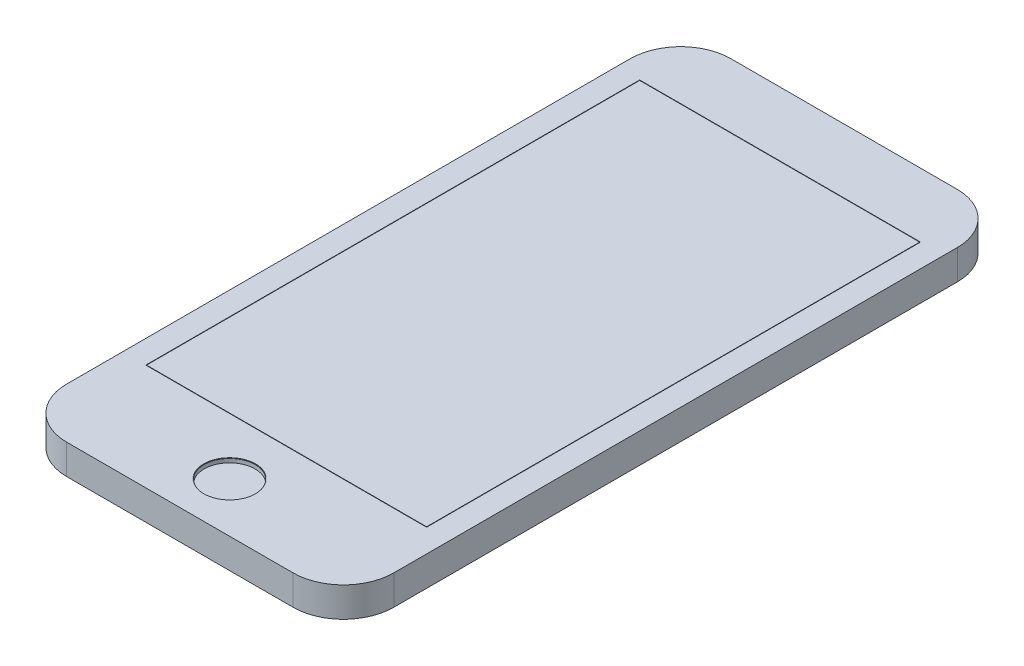
ISO-10303-21;
HEADER;
FILE_DESCRIPTION(('STEP AP214'),'2;1');
FILE_NAME('part.step','',(''),(''),'','','');
FILE_SCHEMA(('AUTOMOTIVE_DESIGN { 1 0 10303 214 1 1 1 1 }'));
ENDSEC;
DATA;
#1=APPLICATION_CONTEXT('core data for automotive mechanical design processes');
#2=APPLICATION_PROTOCOL_DEFINITION('international standard','automotive_design',2000,#1);
#3=PRODUCT_CONTEXT('',#1,'mechanical');
#4=PRODUCT('Part','Part','',(#3));
#5=PRODUCT_RELATED_PRODUCT_CATEGORY('part','',(#4));
#6=PRODUCT_DEFINITION_FORMATION('','',#4);
#7=PRODUCT_DEFINITION_CONTEXT('part definition',#1,'design');
#8=PRODUCT_DEFINITION('design','',#6,#7);
#9=PRODUCT_DEFINITION_SHAPE('','',#8);
#10=(LENGTH_UNIT() NAMED_UNIT(*) SI_UNIT(.MILLI.,.METRE.));
#11=(NAMED_UNIT(*) PLANE_ANGLE_UNIT() SI_UNIT($,.RADIAN.));
#12=(NAMED_UNIT(*) SI_UNIT($,.STERADIAN.) SOLID_ANGLE_UNIT());
#13=UNCERTAINTY_MEASURE_WITH_UNIT(LENGTH_MEASURE(1.E-05),#10,'distance_accuracy_value','');
#14=(GEOMETRIC_REPRESENTATION_CONTEXT(3) GLOBAL_UNCERTAINTY_ASSIGNED_CONTEXT((#13)) GLOBAL_UNIT_ASSIGNED_CONTEXT((#10,
#11,#12)) REPRESENTATION_CONTEXT('',''));
#15=CARTESIAN_POINT('',(0.,0.,0.));
#16=DIRECTION('',(0.,0.,1.));
#17=DIRECTION('',(1.,0.,0.));
#18=AXIS2_PLACEMENT_3D('',#15,#16,#17);
#19=CARTESIAN_POINT('',(26.95,7.1,67.1));
#20=DIRECTION('',(0.,-1.,0.));
#21=DIRECTION('',(0.,0.,-1.));
#22=AXIS2_PLACEMENT_3D('',#19,#20,#21);
#23=CYLINDRICAL_SURFACE('',#22,12.);
#24=CARTESIAN_POINT('',(26.95,0.,67.1));
#25=DIRECTION('',(0.,1.,0.));
#26=DIRECTION('',(0.,0.,1.));
#27=AXIS2_PLACEMENT_3D('',#24,#25,#26);
#28=CIRCLE('',#27,12.);
#29=CARTESIAN_POINT('',(26.9499999999999,0.,79.1));
#30=VERTEX_POINT('',#29);
#31=CARTESIAN_POINT('',(38.95,0.,67.0999999999999));
#32=VERTEX_POINT('',#31);
#33=EDGE_CURVE('E257',#30,#32,#28,.T.);
#34=ORIENTED_EDGE('',*,*,#33,.T.);
#35=DIRECTION('',(0.,-1.,0.));
#36=VECTOR('',#35,1.);
#37=CARTESIAN_POINT('',(38.95,7.1,67.0999999999999));
#38=LINE('',#37,#36);
#39=CARTESIAN_POINT('',(38.95,7.1,67.0999999999999));
#40=VERTEX_POINT('',#39);
#41=EDGE_CURVE('E12',#40,#32,#38,.T.);
#42=ORIENTED_EDGE('',*,*,#41,.F.);
#43=CARTESIAN_POINT('',(26.95,7.1,67.1));
#44=DIRECTION('',(0.,1.,0.));
#45=DIRECTION('',(0.,0.,1.));
#46=AXIS2_PLACEMENT_3D('',#43,#44,#45);
#47=CIRCLE('',#46,12.);
#48=CARTESIAN_POINT('',(26.9499999999999,7.1,79.1));
#49=VERTEX_POINT('',#48);
#50=EDGE_CURVE('E259',#49,#40,#47,.T.);
#51=ORIENTED_EDGE('',*,*,#50,.F.);
#52=DIRECTION('',(0.,-1.,0.));
#53=VECTOR('',#52,1.);
#54=CARTESIAN_POINT('',(26.9499999999999,7.1,79.1));
#55=LINE('',#54,#53);
#56=EDGE_CURVE('E277',#49,#30,#55,.T.);
#57=ORIENTED_EDGE('',*,*,#56,.T.);
#58=EDGE_LOOP('',(#34,#42,#51,#57));
#59=FACE_BOUND('',#58,.T.);
#60=ADVANCED_FACE('F67',(#59),#23,.T.);
#61=CARTESIAN_POINT('',(38.95,7.1,-67.0999999999999));
#62=DIRECTION('',(-1.,0.,0.));
#63=DIRECTION('',(0.,0.,1.));
#64=AXIS2_PLACEMENT_3D('',#61,#62,#63);
#65=PLANE('',#64);
#66=DIRECTION('',(0.,0.,-1.));
#67=VECTOR('',#66,1.);
#68=CARTESIAN_POINT('',(38.95,0.,-67.0999999999999));
#69=LINE('',#68,#67);
#70=CARTESIAN_POINT('',(38.95,0.,-67.0999999999999));
#71=VERTEX_POINT('',#70);
#72=EDGE_CURVE('E280',#32,#71,#69,.T.);
#73=ORIENTED_EDGE('',*,*,#72,.T.);
#74=DIRECTION('',(0.,-1.,0.));
#75=VECTOR('',#74,1.);
#76=CARTESIAN_POINT('',(38.95,7.1,-67.0999999999999));
#77=LINE('',#76,#75);
#78=CARTESIAN_POINT('',(38.95,7.1,-67.0999999999999));
#79=VERTEX_POINT('',#78);
#80=EDGE_CURVE('E74',#79,#71,#77,.T.);
#81=ORIENTED_EDGE('',*,*,#80,.F.);
#82=DIRECTION('',(0.,0.,-1.));
#83=VECTOR('',#82,1.);
#84=CARTESIAN_POINT('',(38.95,7.1,-67.0999999999999));
#85=LINE('',#84,#83);
#86=EDGE_CURVE('E262',#40,#79,#85,.T.);
#87=ORIENTED_EDGE('',*,*,#86,.F.);
#88=ORIENTED_EDGE('',*,*,#41,.T.);
#89=EDGE_LOOP('',(#73,#81,#87,#88));
#90=FACE_BOUND('',#89,.T.);
#91=ADVANCED_FACE('F337',(#90),#65,.F.);
#92=CARTESIAN_POINT('',(26.95,7.1,-67.1));
#93=DIRECTION('',(0.,-1.,0.));
#94=DIRECTION('',(0.,0.,-1.));
#95=AXIS2_PLACEMENT_3D('',#92,#93,#94);
#96=CYLINDRICAL_SURFACE('',#95,12.);
#97=CARTESIAN_POINT('',(26.95,0.,-67.1));
#98=DIRECTION('',(0.,1.,0.));
#99=DIRECTION('',(0.,0.,1.));
#100=AXIS2_PLACEMENT_3D('',#97,#98,#99);
#101=CIRCLE('',#100,12.);
#102=CARTESIAN_POINT('',(26.9499999999999,0.,-79.1));
#103=VERTEX_POINT('',#102);
#104=EDGE_CURVE('E282',#71,#103,#101,.T.);
#105=ORIENTED_EDGE('',*,*,#104,.T.);
#106=DIRECTION('',(0.,-1.,0.));
#107=VECTOR('',#106,1.);
#108=CARTESIAN_POINT('',(26.9499999999999,7.1,-79.1));
#109=LINE('',#108,#107);
#110=CARTESIAN_POINT('',(26.9499999999999,7.1,-79.1));
#111=VERTEX_POINT('',#110);
#112=EDGE_CURVE('E307',#111,#103,#109,.T.);
#113=ORIENTED_EDGE('',*,*,#112,.F.);
#114=CARTESIAN_POINT('',(26.95,7.1,-67.1));
#115=DIRECTION('',(0.,1.,0.));
#116=DIRECTION('',(0.,0.,1.));
#117=AXIS2_PLACEMENT_3D('',#114,#115,#116);
#118=CIRCLE('',#117,12.);
#119=EDGE_CURVE('E265',#79,#111,#118,.T.);
#120=ORIENTED_EDGE('',*,*,#119,.F.);
#121=ORIENTED_EDGE('',*,*,#80,.T.);
#122=EDGE_LOOP('',(#105,#113,#120,#121));
#123=FACE_BOUND('',#122,.T.);
#124=ADVANCED_FACE('F314',(#123),#96,.T.);
#125=CARTESIAN_POINT('',(26.9499999999999,7.1,-79.1));
#126=DIRECTION('',(0.,0.,1.));
#127=DIRECTION('',(1.,0.,0.));
#128=AXIS2_PLACEMENT_3D('',#125,#126,#127);
#129=PLANE('',#128);
#130=DIRECTION('',(-1.,0.,0.));
#131=VECTOR('',#130,1.);
#132=CARTESIAN_POINT('',(26.9499999999999,0.,-79.1));
#133=LINE('',#132,#131);
#134=CARTESIAN_POINT('',(-26.95,0.,-79.1));
#135=VERTEX_POINT('',#134);
#136=EDGE_CURVE('E284',#103,#135,#133,.T.);
#137=ORIENTED_EDGE('',*,*,#136,.T.);
#138=DIRECTION('',(0.,-1.,0.));
#139=VECTOR('',#138,1.);
#140=CARTESIAN_POINT('',(-26.95,7.1,-79.1));
#141=LINE('',#140,#139);
#142=CARTESIAN_POINT('',(-26.95,7.1,-79.1));
#143=VERTEX_POINT('',#142);
#144=EDGE_CURVE('E304',#143,#135,#141,.T.);
#145=ORIENTED_EDGE('',*,*,#144,.F.);
#146=DIRECTION('',(-1.,0.,0.));
#147=VECTOR('',#146,1.);
#148=CARTESIAN_POINT('',(26.9499999999999,7.1,-79.1));
#149=LINE('',#148,#147);
#150=EDGE_CURVE('E267',#111,#143,#149,.T.);
#151=ORIENTED_EDGE('',*,*,#150,.F.);
#152=ORIENTED_EDGE('',*,*,#112,.T.);
#153=EDGE_LOOP('',(#137,#145,#151,#152));
#154=FACE_BOUND('',#153,.T.);
#155=ADVANCED_FACE('F325',(#154),#129,.F.);
#156=CARTESIAN_POINT('',(-26.95,7.1,-67.1));
#157=DIRECTION('',(0.,-1.,0.));
#158=DIRECTION('',(0.,0.,-1.));
#159=AXIS2_PLACEMENT_3D('',#156,#157,#158);
#160=CYLINDRICAL_SURFACE('',#159,12.);
#161=CARTESIAN_POINT('',(-26.95,0.,-67.1));
#162=DIRECTION('',(0.,1.,0.));
#163=DIRECTION('',(0.,0.,-1.));
#164=AXIS2_PLACEMENT_3D('',#161,#162,#163);
#165=CIRCLE('',#164,12.);
#166=CARTESIAN_POINT('',(-38.95,0.,-67.0999999999999));
#167=VERTEX_POINT('',#166);
#168=EDGE_CURVE('E286',#135,#167,#165,.T.);
#169=ORIENTED_EDGE('',*,*,#168,.T.);
#170=DIRECTION('',(0.,-1.,0.));
#171=VECTOR('',#170,1.);
#172=CARTESIAN_POINT('',(-38.95,7.1,-67.0999999999999));
#173=LINE('',#172,#171);
#174=CARTESIAN_POINT('',(-38.95,7.1,-67.0999999999999));
#175=VERTEX_POINT('',#174);
#176=EDGE_CURVE('E301',#175,#167,#173,.T.);
#177=ORIENTED_EDGE('',*,*,#176,.F.);
#178=CARTESIAN_POINT('',(-26.95,7.1,-67.1));
#179=DIRECTION('',(0.,1.,0.));
#180=DIRECTION('',(0.,0.,-1.));
#181=AXIS2_PLACEMENT_3D('',#178,#179,#180);
#182=CIRCLE('',#181,12.);
#183=EDGE_CURVE('E269',#143,#175,#182,.T.);
#184=ORIENTED_EDGE('',*,*,#183,.F.);
#185=ORIENTED_EDGE('',*,*,#144,.T.);
#186=EDGE_LOOP('',(#169,#177,#184,#185));
#187=FACE_BOUND('',#186,.T.);
#188=ADVANCED_FACE('F329',(#187),#160,.T.);
#189=CARTESIAN_POINT('',(-38.95,7.1,-67.0999999999999));
#190=DIRECTION('',(1.,0.,0.));
#191=DIRECTION('',(0.,0.,-1.));
#192=AXIS2_PLACEMENT_3D('',#189,#190,#191);
#193=PLANE('',#192);
#194=DIRECTION('',(0.,0.,1.));
#195=VECTOR('',#194,1.);
#196=CARTESIAN_POINT('',(-38.95,0.,-67.0999999999999));
#197=LINE('',#196,#195);
#198=CARTESIAN_POINT('',(-38.95,0.,67.0999999999999));
#199=VERTEX_POINT('',#198);
#200=EDGE_CURVE('E288',#167,#199,#197,.T.);
#201=ORIENTED_EDGE('',*,*,#200,.T.);
#202=DIRECTION('',(0.,-1.,0.));
#203=VECTOR('',#202,1.);
#204=CARTESIAN_POINT('',(-38.95,7.1,67.0999999999999));
#205=LINE('',#204,#203);
#206=CARTESIAN_POINT('',(-38.95,7.1,67.0999999999999));
#207=VERTEX_POINT('',#206);
#208=EDGE_CURVE('E298',#207,#199,#205,.T.);
#209=ORIENTED_EDGE('',*,*,#208,.F.);
#210=DIRECTION('',(0.,0.,1.));
#211=VECTOR('',#210,1.);
#212=CARTESIAN_POINT('',(-38.95,7.1,-67.0999999999999));
#213=LINE('',#212,#211);
#214=EDGE_CURVE('E271',#175,#207,#213,.T.);
#215=ORIENTED_EDGE('',*,*,#214,.F.);
#216=ORIENTED_EDGE('',*,*,#176,.T.);
#217=EDGE_LOOP('',(#201,#209,#215,#216));
#218=FACE_BOUND('',#217,.T.);
#219=ADVANCED_FACE('F350',(#218),#193,.F.);
#220=CARTESIAN_POINT('',(-26.95,7.1,67.1));
#221=DIRECTION('',(0.,-1.,0.));
#222=DIRECTION('',(0.,0.,-1.));
#223=AXIS2_PLACEMENT_3D('',#220,#221,#222);
#224=CYLINDRICAL_SURFACE('',#223,12.);
#225=CARTESIAN_POINT('',(-26.95,0.,67.1));
#226=DIRECTION('',(0.,1.,0.));
#227=DIRECTION('',(0.,0.,-1.));
#228=AXIS2_PLACEMENT_3D('',#225,#226,#227);
#229=CIRCLE('',#228,12.);
#230=CARTESIAN_POINT('',(-26.9499999999999,0.,79.1));
#231=VERTEX_POINT('',#230);
#232=EDGE_CURVE('E290',#199,#231,#229,.T.);
#233=ORIENTED_EDGE('',*,*,#232,.T.);
#234=DIRECTION('',(0.,-1.,0.));
#235=VECTOR('',#234,1.);
#236=CARTESIAN_POINT('',(-26.9499999999999,7.1,79.1));
#237=LINE('',#236,#235);
#238=CARTESIAN_POINT('',(-26.9499999999999,7.1,79.1));
#239=VERTEX_POINT('',#238);
#240=EDGE_CURVE('E295',#239,#231,#237,.T.);
#241=ORIENTED_EDGE('',*,*,#240,.F.);
#242=CARTESIAN_POINT('',(-26.95,7.1,67.1));
#243=DIRECTION('',(0.,1.,0.));
#244=DIRECTION('',(0.,0.,-1.));
#245=AXIS2_PLACEMENT_3D('',#242,#243,#244);
#246=CIRCLE('',#245,12.);
#247=EDGE_CURVE('E273',#207,#239,#246,.T.);
#248=ORIENTED_EDGE('',*,*,#247,.F.);
#249=ORIENTED_EDGE('',*,*,#208,.T.);
#250=EDGE_LOOP('',(#233,#241,#248,#249));
#251=FACE_BOUND('',#250,.T.);
#252=ADVANCED_FACE('F348',(#251),#224,.T.);
#253=CARTESIAN_POINT('',(26.9499999999999,7.1,79.1));
#254=DIRECTION('',(0.,0.,-1.));
#255=DIRECTION('',(-1.,0.,0.));
#256=AXIS2_PLACEMENT_3D('',#253,#254,#255);
#257=PLANE('',#256);
#258=DIRECTION('',(1.,0.,0.));
#259=VECTOR('',#258,1.);
#260=CARTESIAN_POINT('',(26.9499999999999,0.,79.1));
#261=LINE('',#260,#259);
#262=EDGE_CURVE('E263',#231,#30,#261,.T.);
#263=ORIENTED_EDGE('',*,*,#262,.T.);
#264=ORIENTED_EDGE('',*,*,#56,.F.);
#265=DIRECTION('',(1.,0.,0.));
#266=VECTOR('',#265,1.);
#267=CARTESIAN_POINT('',(26.9499999999999,7.1,79.1));
#268=LINE('',#267,#266);
#269=EDGE_CURVE('E275',#239,#49,#268,.T.);
#270=ORIENTED_EDGE('',*,*,#269,.F.);
#271=ORIENTED_EDGE('',*,*,#240,.T.);
#272=EDGE_LOOP('',(#263,#264,#270,#271));
#273=FACE_BOUND('',#272,.T.);
#274=ADVANCED_FACE('F343',(#273),#257,.F.);
#275=CARTESIAN_POINT('',(26.95,7.1,67.1));
#276=DIRECTION('',(0.,1.,0.));
#277=DIRECTION('',(0.,0.,1.));
#278=AXIS2_PLACEMENT_3D('',#275,#276,#277);
#279=PLANE('',#278);
#280=CARTESIAN_POINT('',(0.,7.1,67.2515398460467));
#281=DIRECTION('',(0.,1.,0.));
#282=DIRECTION('',(1.,0.,0.));
#283=AXIS2_PLACEMENT_3D('',#280,#281,#282);
#284=CIRCLE('',#283,6.17081666967391);
#285=CARTESIAN_POINT('',(6.17081666967389,7.1,67.2515398460467));
#286=VERTEX_POINT('',#285);
#287=EDGE_CURVE('E210',#286,#286,#284,.T.);
#288=ORIENTED_EDGE('',*,*,#287,.F.);
#289=EDGE_LOOP('',(#288));
#290=FACE_BOUND('',#289,.T.);
#291=DIRECTION('',(0.,0.,-1.));
#292=VECTOR('',#291,1.);
#293=CARTESIAN_POINT('',(33.4428160243408,7.1,-63.7497866125761));
#294=LINE('',#293,#292);
#295=CARTESIAN_POINT('',(33.4428160243408,7.1,53.784030831643));
#296=VERTEX_POINT('',#295);
#297=CARTESIAN_POINT('',(33.4428160243408,7.1,-63.8497866125761));
#298=VERTEX_POINT('',#297);
#299=EDGE_CURVE('E81',#296,#298,#294,.T.);
#300=ORIENTED_EDGE('',*,*,#299,.F.);
#301=DIRECTION('',(1.,0.,0.));
#302=VECTOR('',#301,1.);
#303=CARTESIAN_POINT('',(-33.3428160243409,7.1,53.784030831643));
#304=LINE('',#303,#302);
#305=CARTESIAN_POINT('',(-33.4428160243409,7.1,53.784030831643));
#306=VERTEX_POINT('',#305);
#307=EDGE_CURVE('E227',#306,#296,#304,.T.);
#308=ORIENTED_EDGE('',*,*,#307,.F.);
#309=DIRECTION('',(0.,0.,1.));
#310=VECTOR('',#309,1.);
#311=CARTESIAN_POINT('',(-33.4428160243409,7.1,-63.7497866125761));
#312=LINE('',#311,#310);
#313=CARTESIAN_POINT('',(-33.4428160243409,7.1,-63.8497866125761));
#314=VERTEX_POINT('',#313);
#315=EDGE_CURVE('E241',#314,#306,#312,.T.);
#316=ORIENTED_EDGE('',*,*,#315,.F.);
#317=DIRECTION('',(-1.,0.,0.));
#318=VECTOR('',#317,1.);
#319=CARTESIAN_POINT('',(-33.3428160243409,7.1,-63.8497866125761));
#320=LINE('',#319,#318);
#321=EDGE_CURVE('E238',#298,#314,#320,.T.);
#322=ORIENTED_EDGE('',*,*,#321,.F.);
#323=EDGE_LOOP('',(#300,#308,#316,#322));
#324=FACE_BOUND('',#323,.T.);
#325=ORIENTED_EDGE('',*,*,#50,.T.);
#326=ORIENTED_EDGE('',*,*,#86,.T.);
#327=ORIENTED_EDGE('',*,*,#119,.T.);
#328=ORIENTED_EDGE('',*,*,#150,.T.);
#329=ORIENTED_EDGE('',*,*,#183,.T.);
#330=ORIENTED_EDGE('',*,*,#214,.T.);
#331=ORIENTED_EDGE('',*,*,#247,.T.);
#332=ORIENTED_EDGE('',*,*,#269,.T.);
#333=EDGE_LOOP('',(#325,#326,#327,#328,#329,#330,#331,#332));
#334=FACE_BOUND('',#333,.T.);
#335=ADVANCED_FACE('F333',(#290,#324,#334),#279,.T.);
#336=CARTESIAN_POINT('',(26.95,0.,67.1));
#337=DIRECTION('',(0.,1.,0.));
#338=DIRECTION('',(0.,0.,1.));
#339=AXIS2_PLACEMENT_3D('',#336,#337,#338);
#340=PLANE('',#339);
#341=ORIENTED_EDGE('',*,*,#33,.F.);
#342=ORIENTED_EDGE('',*,*,#262,.F.);
#343=ORIENTED_EDGE('',*,*,#232,.F.);
#344=ORIENTED_EDGE('',*,*,#200,.F.);
#345=ORIENTED_EDGE('',*,*,#168,.F.);
#346=ORIENTED_EDGE('',*,*,#136,.F.);
#347=ORIENTED_EDGE('',*,*,#104,.F.);
#348=ORIENTED_EDGE('',*,*,#72,.F.);
#349=EDGE_LOOP('',(#341,#342,#343,#344,#345,#346,#347,#348));
#350=FACE_BOUND('',#349,.T.);
#351=ADVANCED_FACE('F320',(#350),#340,.F.);
#352=CARTESIAN_POINT('',(0.,7.,67.2515398460467));
#353=DIRECTION('',(0.,1.,0.));
#354=DIRECTION('',(0.,0.,1.));
#355=AXIS2_PLACEMENT_3D('',#352,#353,#354);
#356=CYLINDRICAL_SURFACE('',#355,6.17081666967391);
#357=CARTESIAN_POINT('',(0.,7.,67.2515398460467));
#358=DIRECTION('',(0.,1.,0.));
#359=DIRECTION('',(1.,0.,0.));
#360=AXIS2_PLACEMENT_3D('',#357,#358,#359);
#361=CIRCLE('',#360,6.17081666967391);
#362=CARTESIAN_POINT('',(6.17081666967389,7.,67.2515398460467));
#363=VERTEX_POINT('',#362);
#364=EDGE_CURVE('E258',#363,#363,#361,.T.);
#365=ORIENTED_EDGE('',*,*,#364,.F.);
#366=EDGE_LOOP('',(#365));
#367=FACE_BOUND('',#366,.T.);
#368=ORIENTED_EDGE('',*,*,#287,.T.);
#369=EDGE_LOOP('',(#368));
#370=FACE_BOUND('',#369,.T.);
#371=ADVANCED_FACE('F406',(#367,#370),#356,.F.);
#372=CARTESIAN_POINT('',(0.,7.,67.2515398460467));
#373=DIRECTION('',(0.,1.,0.));
#374=DIRECTION('',(0.,0.,1.));
#375=AXIS2_PLACEMENT_3D('',#372,#373,#374);
#376=PLANE('',#375);
#377=CARTESIAN_POINT('',(0.,7.,67.2515398460467));
#378=DIRECTION('',(0.,1.,0.));
#379=DIRECTION('',(0.,0.,1.));
#380=AXIS2_PLACEMENT_3D('',#377,#378,#379);
#381=CIRCLE('',#380,6.07081666967391);
#382=CARTESIAN_POINT('',(0.,7.,73.3223565157206));
#383=VERTEX_POINT('',#382);
#384=EDGE_CURVE('E248',#383,#383,#381,.T.);
#385=ORIENTED_EDGE('',*,*,#384,.F.);
#386=EDGE_LOOP('',(#385));
#387=FACE_BOUND('',#386,.T.);
#388=ORIENTED_EDGE('',*,*,#364,.T.);
#389=EDGE_LOOP('',(#388));
#390=FACE_BOUND('',#389,.T.);
#391=ADVANCED_FACE('F437',(#387,#390),#376,.T.);
#392=CARTESIAN_POINT('',(33.4428160243408,7.,-63.7497866125761));
#393=DIRECTION('',(1.,0.,0.));
#394=DIRECTION('',(0.,0.,-1.));
#395=AXIS2_PLACEMENT_3D('',#392,#393,#394);
#396=PLANE('',#395);
#397=ORIENTED_EDGE('',*,*,#299,.T.);
#398=DIRECTION('',(0.,1.,0.));
#399=VECTOR('',#398,1.);
#400=CARTESIAN_POINT('',(33.4428160243408,7.,-63.8497866125761));
#401=LINE('',#400,#399);
#402=CARTESIAN_POINT('',(33.4428160243408,7.,-63.8497866125761));
#403=VERTEX_POINT('',#402);
#404=EDGE_CURVE('E236',#403,#298,#401,.T.);
#405=ORIENTED_EDGE('',*,*,#404,.F.);
#406=DIRECTION('',(0.,0.,-1.));
#407=VECTOR('',#406,1.);
#408=CARTESIAN_POINT('',(33.4428160243408,7.,-63.7497866125761));
#409=LINE('',#408,#407);
#410=CARTESIAN_POINT('',(33.4428160243408,7.,53.784030831643));
#411=VERTEX_POINT('',#410);
#412=EDGE_CURVE('E223',#411,#403,#409,.T.);
#413=ORIENTED_EDGE('',*,*,#412,.F.);
#414=DIRECTION('',(0.,1.,0.));
#415=VECTOR('',#414,1.);
#416=CARTESIAN_POINT('',(33.4428160243408,7.,53.784030831643));
#417=LINE('',#416,#415);
#418=EDGE_CURVE('E246',#411,#296,#417,.T.);
#419=ORIENTED_EDGE('',*,*,#418,.T.);
#420=EDGE_LOOP('',(#397,#405,#413,#419));
#421=FACE_BOUND('',#420,.T.);
#422=ADVANCED_FACE('F448',(#421),#396,.F.);
#423=CARTESIAN_POINT('',(-33.3428160243409,7.,53.784030831643));
#424=DIRECTION('',(0.,0.,1.));
#425=DIRECTION('',(1.,0.,0.));
#426=AXIS2_PLACEMENT_3D('',#423,#424,#425);
#427=PLANE('',#426);
#428=ORIENTED_EDGE('',*,*,#307,.T.);
#429=ORIENTED_EDGE('',*,*,#418,.F.);
#430=DIRECTION('',(1.,0.,0.));
#431=VECTOR('',#430,1.);
#432=CARTESIAN_POINT('',(-33.3428160243409,7.,53.784030831643));
#433=LINE('',#432,#431);
#434=CARTESIAN_POINT('',(-33.4428160243409,7.,53.784030831643));
#435=VERTEX_POINT('',#434);
#436=EDGE_CURVE('E233',#435,#411,#433,.T.);
#437=ORIENTED_EDGE('',*,*,#436,.F.);
#438=DIRECTION('',(0.,1.,0.));
#439=VECTOR('',#438,1.);
#440=CARTESIAN_POINT('',(-33.4428160243409,7.,53.784030831643));
#441=LINE('',#440,#439);
#442=EDGE_CURVE('E249',#435,#306,#441,.T.);
#443=ORIENTED_EDGE('',*,*,#442,.T.);
#444=EDGE_LOOP('',(#428,#429,#437,#443));
#445=FACE_BOUND('',#444,.T.);
#446=ADVANCED_FACE('F458',(#445),#427,.F.);
#447=CARTESIAN_POINT('',(-33.4428160243409,7.,-63.7497866125761));
#448=DIRECTION('',(-1.,0.,0.));
#449=DIRECTION('',(0.,0.,1.));
#450=AXIS2_PLACEMENT_3D('',#447,#448,#449);
#451=PLANE('',#450);
#452=ORIENTED_EDGE('',*,*,#315,.T.);
#453=ORIENTED_EDGE('',*,*,#442,.F.);
#454=DIRECTION('',(0.,0.,1.));
#455=VECTOR('',#454,1.);
#456=CARTESIAN_POINT('',(-33.4428160243409,7.,-63.7497866125761));
#457=LINE('',#456,#455);
#458=CARTESIAN_POINT('',(-33.4428160243409,7.,-63.8497866125761));
#459=VERTEX_POINT('',#458);
#460=EDGE_CURVE('E230',#459,#435,#457,.T.);
#461=ORIENTED_EDGE('',*,*,#460,.F.);
#462=DIRECTION('',(0.,1.,0.));
#463=VECTOR('',#462,1.);
#464=CARTESIAN_POINT('',(-33.4428160243409,7.,-63.8497866125761));
#465=LINE('',#464,#463);
#466=EDGE_CURVE('E251',#459,#314,#465,.T.);
#467=ORIENTED_EDGE('',*,*,#466,.T.);
#468=EDGE_LOOP('',(#452,#453,#461,#467));
#469=FACE_BOUND('',#468,.T.);
#470=ADVANCED_FACE('F467',(#469),#451,.F.);
#471=CARTESIAN_POINT('',(-33.3428160243409,7.,-63.8497866125761));
#472=DIRECTION('',(0.,0.,-1.));
#473=DIRECTION('',(-1.,0.,0.));
#474=AXIS2_PLACEMENT_3D('',#471,#472,#473);
#475=PLANE('',#474);
#476=ORIENTED_EDGE('',*,*,#321,.T.);
#477=ORIENTED_EDGE('',*,*,#466,.F.);
#478=DIRECTION('',(-1.,0.,0.));
#479=VECTOR('',#478,1.);
#480=CARTESIAN_POINT('',(-33.3428160243409,7.,-63.8497866125761));
#481=LINE('',#480,#479);
#482=EDGE_CURVE('E226',#403,#459,#481,.T.);
#483=ORIENTED_EDGE('',*,*,#482,.F.);
#484=ORIENTED_EDGE('',*,*,#404,.T.);
#485=EDGE_LOOP('',(#476,#477,#483,#484));
#486=FACE_BOUND('',#485,.T.);
#487=ADVANCED_FACE('F477',(#486),#475,.F.);
#488=CARTESIAN_POINT('',(0.,7.,0.));
#489=DIRECTION('',(0.,1.,0.));
#490=DIRECTION('',(0.,0.,1.));
#491=AXIS2_PLACEMENT_3D('',#488,#489,#490);
#492=PLANE('',#491);
#493=DIRECTION('',(1.,0.,0.));
#494=VECTOR('',#493,1.);
#495=CARTESIAN_POINT('',(-33.3428160243409,7.,53.684030831643));
#496=LINE('',#495,#494);
#497=CARTESIAN_POINT('',(-33.3428160243409,7.,53.684030831643));
#498=VERTEX_POINT('',#497);
#499=CARTESIAN_POINT('',(33.3428160243408,7.,53.684030831643));
#500=VERTEX_POINT('',#499);
#501=EDGE_CURVE('E191',#498,#500,#496,.T.);
#502=ORIENTED_EDGE('',*,*,#501,.F.);
#503=DIRECTION('',(0.,0.,1.));
#504=VECTOR('',#503,1.);
#505=CARTESIAN_POINT('',(-33.3428160243409,7.,-63.7497866125761));
#506=LINE('',#505,#504);
#507=CARTESIAN_POINT('',(-33.3428160243409,7.,-63.7497866125761));
#508=VERTEX_POINT('',#507);
#509=EDGE_CURVE('E201',#508,#498,#506,.T.);
#510=ORIENTED_EDGE('',*,*,#509,.F.);
#511=DIRECTION('',(-1.,0.,0.));
#512=VECTOR('',#511,1.);
#513=CARTESIAN_POINT('',(-33.3428160243409,7.,-63.7497866125761));
#514=LINE('',#513,#512);
#515=CARTESIAN_POINT('',(33.3428160243408,7.,-63.7497866125761));
#516=VERTEX_POINT('',#515);
#517=EDGE_CURVE('E183',#516,#508,#514,.T.);
#518=ORIENTED_EDGE('',*,*,#517,.F.);
#519=DIRECTION('',(0.,0.,-1.));
#520=VECTOR('',#519,1.);
#521=CARTESIAN_POINT('',(33.3428160243408,7.,-63.7497866125761));
#522=LINE('',#521,#520);
#523=EDGE_CURVE('E198',#500,#516,#522,.T.);
#524=ORIENTED_EDGE('',*,*,#523,.F.);
#525=EDGE_LOOP('',(#502,#510,#518,#524));
#526=FACE_BOUND('',#525,.T.);
#527=ORIENTED_EDGE('',*,*,#412,.T.);
#528=ORIENTED_EDGE('',*,*,#482,.T.);
#529=ORIENTED_EDGE('',*,*,#460,.T.);
#530=ORIENTED_EDGE('',*,*,#436,.T.);
#531=EDGE_LOOP('',(#527,#528,#529,#530));
#532=FACE_BOUND('',#531,.T.);
#533=ADVANCED_FACE('F196',(#526,#532),#492,.T.);
#534=CARTESIAN_POINT('',(33.3428160243408,7.,-63.7497866125761));
#535=DIRECTION('',(1.,0.,0.));
#536=DIRECTION('',(0.,0.,-1.));
#537=AXIS2_PLACEMENT_3D('',#534,#535,#536);
#538=PLANE('',#537);
#539=DIRECTION('',(0.,0.,-1.));
#540=VECTOR('',#539,1.);
#541=CARTESIAN_POINT('',(33.3428160243408,7.1,-63.7497866125761));
#542=LINE('',#541,#540);
#543=CARTESIAN_POINT('',(33.3428160243408,7.1,53.684030831643));
#544=VERTEX_POINT('',#543);
#545=CARTESIAN_POINT('',(33.3428160243408,7.1,-63.7497866125761));
#546=VERTEX_POINT('',#545);
#547=EDGE_CURVE('E215',#544,#546,#542,.T.);
#548=ORIENTED_EDGE('',*,*,#547,.F.);
#549=DIRECTION('',(0.,1.,0.));
#550=VECTOR('',#549,1.);
#551=CARTESIAN_POINT('',(33.3428160243408,7.,53.684030831643));
#552=LINE('',#551,#550);
#553=EDGE_CURVE('E204',#500,#544,#552,.T.);
#554=ORIENTED_EDGE('',*,*,#553,.F.);
#555=ORIENTED_EDGE('',*,*,#523,.T.);
#556=DIRECTION('',(0.,1.,0.));
#557=VECTOR('',#556,1.);
#558=CARTESIAN_POINT('',(33.3428160243408,7.,-63.7497866125761));
#559=LINE('',#558,#557);
#560=EDGE_CURVE('E180',#516,#546,#559,.T.);
#561=ORIENTED_EDGE('',*,*,#560,.T.);
#562=EDGE_LOOP('',(#548,#554,#555,#561));
#563=FACE_BOUND('',#562,.T.);
#564=ADVANCED_FACE('F203',(#563),#538,.T.);
#565=CARTESIAN_POINT('',(-33.3428160243409,7.,53.684030831643));
#566=DIRECTION('',(0.,0.,1.));
#567=DIRECTION('',(1.,0.,0.));
#568=AXIS2_PLACEMENT_3D('',#565,#566,#567);
#569=PLANE('',#568);
#570=DIRECTION('',(1.,0.,0.));
#571=VECTOR('',#570,1.);
#572=CARTESIAN_POINT('',(-33.3428160243409,7.1,53.684030831643));
#573=LINE('',#572,#571);
#574=CARTESIAN_POINT('',(-33.3428160243409,7.1,53.684030831643));
#575=VERTEX_POINT('',#574);
#576=EDGE_CURVE('E205',#575,#544,#573,.T.);
#577=ORIENTED_EDGE('',*,*,#576,.F.);
#578=DIRECTION('',(0.,1.,0.));
#579=VECTOR('',#578,1.);
#580=CARTESIAN_POINT('',(-33.3428160243409,7.,53.684030831643));
#581=LINE('',#580,#579);
#582=EDGE_CURVE('E220',#498,#575,#581,.T.);
#583=ORIENTED_EDGE('',*,*,#582,.F.);
#584=ORIENTED_EDGE('',*,*,#501,.T.);
#585=ORIENTED_EDGE('',*,*,#553,.T.);
#586=EDGE_LOOP('',(#577,#583,#584,#585));
#587=FACE_BOUND('',#586,.T.);
#588=ADVANCED_FACE('F504',(#587),#569,.T.);
#589=CARTESIAN_POINT('',(-33.3428160243409,7.,-63.7497866125761));
#590=DIRECTION('',(-1.,0.,0.));
#591=DIRECTION('',(0.,0.,1.));
#592=AXIS2_PLACEMENT_3D('',#589,#590,#591);
#593=PLANE('',#592);
#594=DIRECTION('',(0.,0.,1.));
#595=VECTOR('',#594,1.);
#596=CARTESIAN_POINT('',(-33.3428160243409,7.1,-63.7497866125761));
#597=LINE('',#596,#595);
#598=CARTESIAN_POINT('',(-33.3428160243409,7.1,-63.7497866125761));
#599=VERTEX_POINT('',#598);
#600=EDGE_CURVE('E89',#599,#575,#597,.T.);
#601=ORIENTED_EDGE('',*,*,#600,.F.);
#602=DIRECTION('',(0.,1.,0.));
#603=VECTOR('',#602,1.);
#604=CARTESIAN_POINT('',(-33.3428160243409,7.,-63.7497866125761));
#605=LINE('',#604,#603);
#606=EDGE_CURVE('E190',#508,#599,#605,.T.);
#607=ORIENTED_EDGE('',*,*,#606,.F.);
#608=ORIENTED_EDGE('',*,*,#509,.T.);
#609=ORIENTED_EDGE('',*,*,#582,.T.);
#610=EDGE_LOOP('',(#601,#607,#608,#609));
#611=FACE_BOUND('',#610,.T.);
#612=ADVANCED_FACE('F513',(#611),#593,.T.);
#613=CARTESIAN_POINT('',(-33.3428160243409,7.,-63.7497866125761));
#614=DIRECTION('',(0.,0.,-1.));
#615=DIRECTION('',(-1.,0.,0.));
#616=AXIS2_PLACEMENT_3D('',#613,#614,#615);
#617=PLANE('',#616);
#618=DIRECTION('',(-1.,0.,0.));
#619=VECTOR('',#618,1.);
#620=CARTESIAN_POINT('',(-33.3428160243409,7.1,-63.7497866125761));
#621=LINE('',#620,#619);
#622=EDGE_CURVE('E185',#546,#599,#621,.T.);
#623=ORIENTED_EDGE('',*,*,#622,.F.);
#624=ORIENTED_EDGE('',*,*,#560,.F.);
#625=ORIENTED_EDGE('',*,*,#517,.T.);
#626=ORIENTED_EDGE('',*,*,#606,.T.);
#627=EDGE_LOOP('',(#623,#624,#625,#626));
#628=FACE_BOUND('',#627,.T.);
#629=ADVANCED_FACE('F182',(#628),#617,.T.);
#630=CARTESIAN_POINT('',(0.,6.1,0.));
#631=DIRECTION('',(0.,1.,0.));
#632=DIRECTION('',(0.,0.,1.));
#633=AXIS2_PLACEMENT_3D('',#630,#631,#632);
#634=PLANE('',#633);
#635=CARTESIAN_POINT('',(0.,6.1,67.2515398460467));
#636=DIRECTION('',(0.,1.,0.));
#637=DIRECTION('',(0.,0.,1.));
#638=AXIS2_PLACEMENT_3D('',#635,#636,#637);
#639=CIRCLE('',#638,6.07081666967391);
#640=CARTESIAN_POINT('',(0.,6.1,73.3223565157206));
#641=VERTEX_POINT('',#640);
#642=EDGE_CURVE('E254',#641,#641,#639,.T.);
#643=ORIENTED_EDGE('',*,*,#642,.T.);
#644=EDGE_LOOP('',(#643));
#645=FACE_BOUND('',#644,.T.);
#646=ADVANCED_FACE('F413',(#645),#634,.T.);
#647=CARTESIAN_POINT('',(0.,6.1,67.2515398460467));
#648=DIRECTION('',(0.,1.,0.));
#649=DIRECTION('',(0.,0.,1.));
#650=AXIS2_PLACEMENT_3D('',#647,#648,#649);
#651=CYLINDRICAL_SURFACE('',#650,6.07081666967391);
#652=ORIENTED_EDGE('',*,*,#642,.F.);
#653=EDGE_LOOP('',(#652));
#654=FACE_BOUND('',#653,.T.);
#655=ORIENTED_EDGE('',*,*,#384,.T.);
#656=EDGE_LOOP('',(#655));
#657=FACE_BOUND('',#656,.T.);
#658=ADVANCED_FACE('F417',(#654,#657),#651,.F.);
#659=ORIENTED_EDGE('',*,*,#576,.T.);
#660=ORIENTED_EDGE('',*,*,#547,.T.);
#661=ORIENTED_EDGE('',*,*,#622,.T.);
#662=ORIENTED_EDGE('',*,*,#600,.T.);
#663=EDGE_LOOP('',(#659,#660,#661,#662));
#664=FACE_BOUND('',#663,.T.);
#665=ADVANCED_FACE('F430',(#664),#279,.T.);
#666=CLOSED_SHELL('',(#60,#91,#124,#155,#188,#219,#252,#274,#335,#351,#371,#391,#422,#446,#470,
#487,#533,#564,#588,#612,#629,#646,#658,#665));
#667=MANIFOLD_SOLID_BREP('B2',#666);
#668=ADVANCED_BREP_SHAPE_REPRESENTATION('',(#18,#667),#14);
#669=SHAPE_DEFINITION_REPRESENTATION(#9,#668);
ENDSEC;
END-ISO-10303-21;
